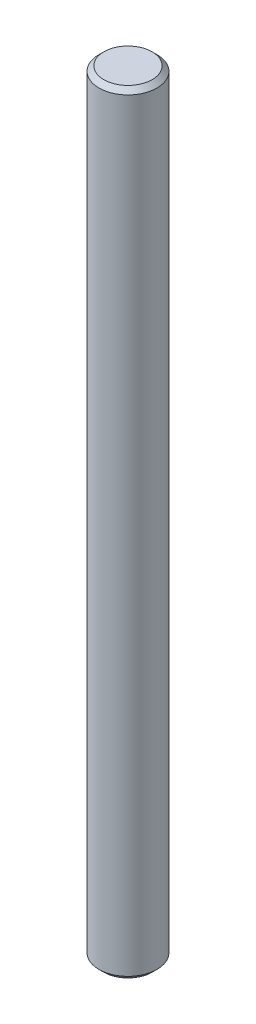
ISO-10303-21;
HEADER;
FILE_DESCRIPTION(('STEP AP214'),'2;1');
FILE_NAME('part.step','',(''),(''),'','','');
FILE_SCHEMA(('AUTOMOTIVE_DESIGN { 1 0 10303 214 1 1 1 1 }'));
ENDSEC;
DATA;
#1=APPLICATION_CONTEXT('core data for automotive mechanical design processes');
#2=APPLICATION_PROTOCOL_DEFINITION('international standard','automotive_design',2000,#1);
#3=PRODUCT_CONTEXT('',#1,'mechanical');
#4=PRODUCT('Part','Part','',(#3));
#5=PRODUCT_RELATED_PRODUCT_CATEGORY('part','',(#4));
#6=PRODUCT_DEFINITION_FORMATION('','',#4);
#7=PRODUCT_DEFINITION_CONTEXT('part definition',#1,'design');
#8=PRODUCT_DEFINITION('design','',#6,#7);
#9=PRODUCT_DEFINITION_SHAPE('','',#8);
#10=(LENGTH_UNIT() NAMED_UNIT(*) SI_UNIT(.MILLI.,.METRE.));
#11=(NAMED_UNIT(*) PLANE_ANGLE_UNIT() SI_UNIT($,.RADIAN.));
#12=(NAMED_UNIT(*) SI_UNIT($,.STERADIAN.) SOLID_ANGLE_UNIT());
#13=UNCERTAINTY_MEASURE_WITH_UNIT(LENGTH_MEASURE(1.E-05),#10,'distance_accuracy_value','');
#14=(GEOMETRIC_REPRESENTATION_CONTEXT(3) GLOBAL_UNCERTAINTY_ASSIGNED_CONTEXT((#13)) GLOBAL_UNIT_ASSIGNED_CONTEXT((#10,
#11,#12)) REPRESENTATION_CONTEXT('',''));
#15=CARTESIAN_POINT('',(0.,0.,0.));
#16=DIRECTION('',(0.,0.,1.));
#17=DIRECTION('',(1.,0.,0.));
#18=AXIS2_PLACEMENT_3D('',#15,#16,#17);
#19=CARTESIAN_POINT('',(0.,80.,0.));
#20=DIRECTION('',(0.,-1.,0.));
#21=DIRECTION('',(0.,0.,-1.));
#22=AXIS2_PLACEMENT_3D('',#19,#20,#21);
#23=CYLINDRICAL_SURFACE('',#22,3.);
#24=CARTESIAN_POINT('',(0.,0.499999999999987,0.));
#25=DIRECTION('',(0.,1.,0.));
#26=DIRECTION('',(0.,0.,1.));
#27=AXIS2_PLACEMENT_3D('',#24,#25,#26);
#28=CIRCLE('',#27,3.);
#29=CARTESIAN_POINT('',(0.,0.499999999999987,3.));
#30=VERTEX_POINT('',#29);
#31=EDGE_CURVE('E41',#30,#30,#28,.T.);
#32=ORIENTED_EDGE('',*,*,#31,.T.);
#33=EDGE_LOOP('',(#32));
#34=FACE_BOUND('',#33,.T.);
#35=CARTESIAN_POINT('',(0.,79.5,0.));
#36=DIRECTION('',(0.,1.,0.));
#37=DIRECTION('',(0.,0.,1.));
#38=AXIS2_PLACEMENT_3D('',#35,#36,#37);
#39=CIRCLE('',#38,3.);
#40=CARTESIAN_POINT('',(0.,79.5,3.));
#41=VERTEX_POINT('',#40);
#42=EDGE_CURVE('E45',#41,#41,#39,.F.);
#43=ORIENTED_EDGE('',*,*,#42,.T.);
#44=EDGE_LOOP('',(#43));
#45=FACE_BOUND('',#44,.T.);
#46=ADVANCED_FACE('F30',(#34,#45),#23,.T.);
#47=CARTESIAN_POINT('',(0.,80.,0.));
#48=DIRECTION('',(0.,1.,0.));
#49=DIRECTION('',(0.,0.,1.));
#50=AXIS2_PLACEMENT_3D('',#47,#48,#49);
#51=PLANE('',#50);
#52=CARTESIAN_POINT('',(0.,80.,0.));
#53=DIRECTION('',(0.,1.,0.));
#54=DIRECTION('',(0.,0.,1.));
#55=AXIS2_PLACEMENT_3D('',#52,#53,#54);
#56=CIRCLE('',#55,2.5);
#57=CARTESIAN_POINT('',(0.,80.,2.5));
#58=VERTEX_POINT('',#57);
#59=EDGE_CURVE('E10',#58,#58,#56,.T.);
#60=ORIENTED_EDGE('',*,*,#59,.T.);
#61=EDGE_LOOP('',(#60));
#62=FACE_BOUND('',#61,.T.);
#63=ADVANCED_FACE('F61',(#62),#51,.T.);
#64=CARTESIAN_POINT('',(0.,0.,0.));
#65=DIRECTION('',(0.,1.,0.));
#66=DIRECTION('',(0.,0.,1.));
#67=AXIS2_PLACEMENT_3D('',#64,#65,#66);
#68=PLANE('',#67);
#69=CARTESIAN_POINT('',(0.,0.,0.));
#70=DIRECTION('',(0.,1.,0.));
#71=DIRECTION('',(0.,0.,1.));
#72=AXIS2_PLACEMENT_3D('',#69,#70,#71);
#73=CIRCLE('',#72,2.50000000000002);
#74=CARTESIAN_POINT('',(0.,0.,2.50000000000002));
#75=VERTEX_POINT('',#74);
#76=EDGE_CURVE('E37',#75,#75,#73,.F.);
#77=ORIENTED_EDGE('',*,*,#76,.T.);
#78=EDGE_LOOP('',(#77));
#79=FACE_BOUND('',#78,.T.);
#80=ADVANCED_FACE('F58',(#79),#68,.F.);
#81=CARTESIAN_POINT('',(0.,0.499999999999987,0.));
#82=DIRECTION('',(0.,1.,0.));
#83=DIRECTION('',(0.,0.,1.));
#84=AXIS2_PLACEMENT_3D('',#81,#82,#83);
#85=CONICAL_SURFACE('',#84,3.,0.785398163397445);
#86=ORIENTED_EDGE('',*,*,#76,.F.);
#87=EDGE_LOOP('',(#86));
#88=FACE_BOUND('',#87,.T.);
#89=ORIENTED_EDGE('',*,*,#31,.F.);
#90=EDGE_LOOP('',(#89));
#91=FACE_BOUND('',#90,.T.);
#92=ADVANCED_FACE('F54',(#88,#91),#85,.T.);
#93=CARTESIAN_POINT('',(0.,80.,0.));
#94=DIRECTION('',(0.,-1.,0.));
#95=DIRECTION('',(0.,0.,-1.));
#96=AXIS2_PLACEMENT_3D('',#93,#94,#95);
#97=CONICAL_SURFACE('',#96,2.5,0.785398163397452);
#98=ORIENTED_EDGE('',*,*,#42,.F.);
#99=EDGE_LOOP('',(#98));
#100=FACE_BOUND('',#99,.T.);
#101=ORIENTED_EDGE('',*,*,#59,.F.);
#102=EDGE_LOOP('',(#101));
#103=FACE_BOUND('',#102,.T.);
#104=ADVANCED_FACE('F32',(#100,#103),#97,.T.);
#105=CLOSED_SHELL('',(#46,#63,#80,#92,#104));
#106=MANIFOLD_SOLID_BREP('B2',#105);
#107=ADVANCED_BREP_SHAPE_REPRESENTATION('',(#18,#106),#14);
#108=SHAPE_DEFINITION_REPRESENTATION(#9,#107);
ENDSEC;
END-ISO-10303-21;
